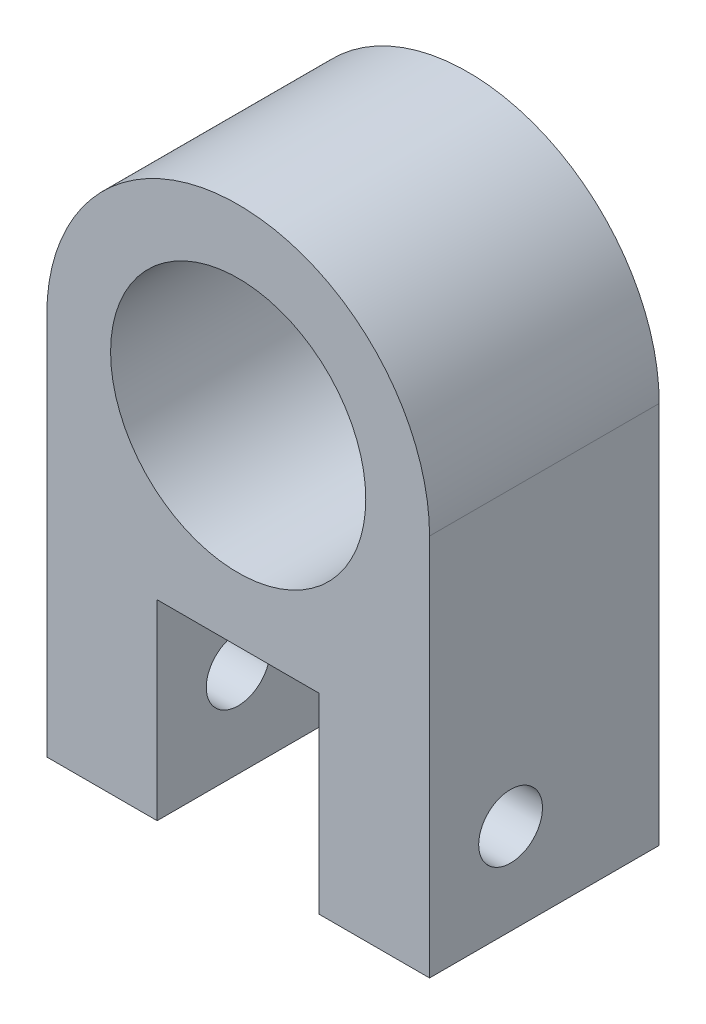
ISO-10303-21;
HEADER;
FILE_DESCRIPTION(('STEP AP214'),'2;1');
FILE_NAME('part.step','',(''),(''),'','','');
FILE_SCHEMA(('AUTOMOTIVE_DESIGN { 1 0 10303 214 1 1 1 1 }'));
ENDSEC;
DATA;
#1=APPLICATION_CONTEXT('core data for automotive mechanical design processes');
#2=APPLICATION_PROTOCOL_DEFINITION('international standard','automotive_design',2000,#1);
#3=PRODUCT_CONTEXT('',#1,'mechanical');
#4=PRODUCT('Part','Part','',(#3));
#5=PRODUCT_RELATED_PRODUCT_CATEGORY('part','',(#4));
#6=PRODUCT_DEFINITION_FORMATION('','',#4);
#7=PRODUCT_DEFINITION_CONTEXT('part definition',#1,'design');
#8=PRODUCT_DEFINITION('design','',#6,#7);
#9=PRODUCT_DEFINITION_SHAPE('','',#8);
#10=(LENGTH_UNIT() NAMED_UNIT(*) SI_UNIT(.MILLI.,.METRE.));
#11=(NAMED_UNIT(*) PLANE_ANGLE_UNIT() SI_UNIT($,.RADIAN.));
#12=(NAMED_UNIT(*) SI_UNIT($,.STERADIAN.) SOLID_ANGLE_UNIT());
#13=UNCERTAINTY_MEASURE_WITH_UNIT(LENGTH_MEASURE(1.E-05),#10,'distance_accuracy_value','');
#14=(GEOMETRIC_REPRESENTATION_CONTEXT(3) GLOBAL_UNCERTAINTY_ASSIGNED_CONTEXT((#13)) GLOBAL_UNIT_ASSIGNED_CONTEXT((#10,
#11,#12)) REPRESENTATION_CONTEXT('',''));
#15=CARTESIAN_POINT('',(0.,0.,0.));
#16=DIRECTION('',(0.,0.,1.));
#17=DIRECTION('',(1.,0.,0.));
#18=AXIS2_PLACEMENT_3D('',#15,#16,#17);
#19=CARTESIAN_POINT('',(15.,30.,18.));
#20=DIRECTION('',(0.,0.,-1.));
#21=DIRECTION('',(-1.,0.,0.));
#22=AXIS2_PLACEMENT_3D('',#19,#20,#21);
#23=PLANE('',#22);
#24=DIRECTION('',(-1.,0.,0.));
#25=VECTOR('',#24,1.);
#26=CARTESIAN_POINT('',(8.65,15.,18.));
#27=LINE('',#26,#25);
#28=CARTESIAN_POINT('',(21.35,15.,18.));
#29=VERTEX_POINT('',#28);
#30=CARTESIAN_POINT('',(8.65,15.,18.));
#31=VERTEX_POINT('',#30);
#32=EDGE_CURVE('E130',#29,#31,#27,.T.);
#33=ORIENTED_EDGE('',*,*,#32,.F.);
#34=DIRECTION('',(0.,1.,0.));
#35=VECTOR('',#34,1.);
#36=CARTESIAN_POINT('',(21.35,15.,18.));
#37=LINE('',#36,#35);
#38=CARTESIAN_POINT('',(21.35,0.,18.));
#39=VERTEX_POINT('',#38);
#40=EDGE_CURVE('E115',#39,#29,#37,.T.);
#41=ORIENTED_EDGE('',*,*,#40,.F.);
#42=DIRECTION('',(1.,0.,0.));
#43=VECTOR('',#42,1.);
#44=CARTESIAN_POINT('',(0.,0.,18.));
#45=LINE('',#44,#43);
#46=CARTESIAN_POINT('',(30.,0.,18.));
#47=VERTEX_POINT('',#46);
#48=EDGE_CURVE('E154',#39,#47,#45,.T.);
#49=ORIENTED_EDGE('',*,*,#48,.T.);
#50=DIRECTION('',(0.,1.,0.));
#51=VECTOR('',#50,1.);
#52=CARTESIAN_POINT('',(30.,0.,18.));
#53=LINE('',#52,#51);
#54=CARTESIAN_POINT('',(30.,30.,18.));
#55=VERTEX_POINT('',#54);
#56=EDGE_CURVE('E156',#47,#55,#53,.T.);
#57=ORIENTED_EDGE('',*,*,#56,.T.);
#58=CARTESIAN_POINT('',(15.,30.,18.));
#59=DIRECTION('',(0.,0.,1.));
#60=DIRECTION('',(-1.,0.,0.));
#61=AXIS2_PLACEMENT_3D('',#58,#59,#60);
#62=CIRCLE('',#61,15.);
#63=CARTESIAN_POINT('',(0.,30.,18.));
#64=VERTEX_POINT('',#63);
#65=EDGE_CURVE('E57',#55,#64,#62,.T.);
#66=ORIENTED_EDGE('',*,*,#65,.T.);
#67=DIRECTION('',(0.,-1.,0.));
#68=VECTOR('',#67,1.);
#69=CARTESIAN_POINT('',(0.,0.,18.));
#70=LINE('',#69,#68);
#71=CARTESIAN_POINT('',(0.,0.,18.));
#72=VERTEX_POINT('',#71);
#73=EDGE_CURVE('E152',#64,#72,#70,.T.);
#74=ORIENTED_EDGE('',*,*,#73,.T.);
#75=CARTESIAN_POINT('',(8.65,0.,18.));
#76=VERTEX_POINT('',#75);
#77=EDGE_CURVE('E85',#72,#76,#45,.T.);
#78=ORIENTED_EDGE('',*,*,#77,.T.);
#79=DIRECTION('',(0.,-1.,0.));
#80=VECTOR('',#79,1.);
#81=CARTESIAN_POINT('',(8.65,15.,18.));
#82=LINE('',#81,#80);
#83=EDGE_CURVE('E128',#31,#76,#82,.T.);
#84=ORIENTED_EDGE('',*,*,#83,.F.);
#85=EDGE_LOOP('',(#33,#41,#49,#57,#66,#74,#78,#84));
#86=FACE_BOUND('',#85,.T.);
#87=CARTESIAN_POINT('',(15.,30.,18.));
#88=DIRECTION('',(0.,0.,1.));
#89=DIRECTION('',(1.,0.,0.));
#90=AXIS2_PLACEMENT_3D('',#87,#88,#89);
#91=CIRCLE('',#90,10.);
#92=CARTESIAN_POINT('',(25.,30.,18.));
#93=VERTEX_POINT('',#92);
#94=EDGE_CURVE('E146',#93,#93,#91,.T.);
#95=ORIENTED_EDGE('',*,*,#94,.F.);
#96=EDGE_LOOP('',(#95));
#97=FACE_BOUND('',#96,.T.);
#98=ADVANCED_FACE('F32',(#86,#97),#23,.F.);
#99=CARTESIAN_POINT('',(15.,30.,0.));
#100=DIRECTION('',(0.,0.,-1.));
#101=DIRECTION('',(-1.,0.,0.));
#102=AXIS2_PLACEMENT_3D('',#99,#100,#101);
#103=PLANE('',#102);
#104=DIRECTION('',(0.,-1.,0.));
#105=VECTOR('',#104,1.);
#106=CARTESIAN_POINT('',(0.,0.,0.));
#107=LINE('',#106,#105);
#108=CARTESIAN_POINT('',(0.,30.,0.));
#109=VERTEX_POINT('',#108);
#110=CARTESIAN_POINT('',(0.,0.,0.));
#111=VERTEX_POINT('',#110);
#112=EDGE_CURVE('E149',#109,#111,#107,.T.);
#113=ORIENTED_EDGE('',*,*,#112,.F.);
#114=CARTESIAN_POINT('',(15.,30.,0.));
#115=DIRECTION('',(0.,0.,1.));
#116=DIRECTION('',(-1.,0.,0.));
#117=AXIS2_PLACEMENT_3D('',#114,#115,#116);
#118=CIRCLE('',#117,15.);
#119=CARTESIAN_POINT('',(30.,30.,0.));
#120=VERTEX_POINT('',#119);
#121=EDGE_CURVE('E78',#120,#109,#118,.T.);
#122=ORIENTED_EDGE('',*,*,#121,.F.);
#123=DIRECTION('',(0.,1.,0.));
#124=VECTOR('',#123,1.);
#125=CARTESIAN_POINT('',(30.,0.,0.));
#126=LINE('',#125,#124);
#127=CARTESIAN_POINT('',(30.,0.,0.));
#128=VERTEX_POINT('',#127);
#129=EDGE_CURVE('E164',#128,#120,#126,.T.);
#130=ORIENTED_EDGE('',*,*,#129,.F.);
#131=DIRECTION('',(1.,0.,0.));
#132=VECTOR('',#131,1.);
#133=CARTESIAN_POINT('',(0.,0.,0.));
#134=LINE('',#133,#132);
#135=EDGE_CURVE('E162',#111,#128,#134,.T.);
#136=ORIENTED_EDGE('',*,*,#135,.F.);
#137=EDGE_LOOP('',(#113,#122,#130,#136));
#138=FACE_BOUND('',#137,.T.);
#139=CARTESIAN_POINT('',(15.,30.,0.));
#140=DIRECTION('',(0.,0.,1.));
#141=DIRECTION('',(1.,0.,0.));
#142=AXIS2_PLACEMENT_3D('',#139,#140,#141);
#143=CIRCLE('',#142,10.);
#144=CARTESIAN_POINT('',(25.,30.,0.));
#145=VERTEX_POINT('',#144);
#146=EDGE_CURVE('E142',#145,#145,#143,.T.);
#147=ORIENTED_EDGE('',*,*,#146,.T.);
#148=EDGE_LOOP('',(#147));
#149=FACE_BOUND('',#148,.T.);
#150=ADVANCED_FACE('F180',(#138,#149),#103,.T.);
#151=CARTESIAN_POINT('',(0.,0.,18.));
#152=DIRECTION('',(1.,0.,0.));
#153=DIRECTION('',(0.,0.,-1.));
#154=AXIS2_PLACEMENT_3D('',#151,#152,#153);
#155=PLANE('',#154);
#156=CARTESIAN_POINT('',(0.,7.125,11.65));
#157=DIRECTION('',(-1.,0.,0.));
#158=DIRECTION('',(0.,0.,1.));
#159=AXIS2_PLACEMENT_3D('',#156,#157,#158);
#160=CIRCLE('',#159,2.5);
#161=CARTESIAN_POINT('',(0.,7.125,14.15));
#162=VERTEX_POINT('',#161);
#163=EDGE_CURVE('E233',#162,#162,#160,.T.);
#164=ORIENTED_EDGE('',*,*,#163,.F.);
#165=EDGE_LOOP('',(#164));
#166=FACE_BOUND('',#165,.T.);
#167=ORIENTED_EDGE('',*,*,#112,.T.);
#168=DIRECTION('',(0.,0.,-1.));
#169=VECTOR('',#168,1.);
#170=CARTESIAN_POINT('',(0.,0.,18.));
#171=LINE('',#170,#169);
#172=EDGE_CURVE('E11',#72,#111,#171,.T.);
#173=ORIENTED_EDGE('',*,*,#172,.F.);
#174=ORIENTED_EDGE('',*,*,#73,.F.);
#175=DIRECTION('',(0.,0.,-1.));
#176=VECTOR('',#175,1.);
#177=CARTESIAN_POINT('',(0.,30.,18.));
#178=LINE('',#177,#176);
#179=EDGE_CURVE('E159',#64,#109,#178,.T.);
#180=ORIENTED_EDGE('',*,*,#179,.T.);
#181=EDGE_LOOP('',(#167,#173,#174,#180));
#182=FACE_BOUND('',#181,.T.);
#183=ADVANCED_FACE('F34',(#166,#182),#155,.F.);
#184=CARTESIAN_POINT('',(0.,0.,18.));
#185=DIRECTION('',(0.,1.,0.));
#186=DIRECTION('',(0.,0.,1.));
#187=AXIS2_PLACEMENT_3D('',#184,#185,#186);
#188=PLANE('',#187);
#189=ORIENTED_EDGE('',*,*,#48,.F.);
#190=DIRECTION('',(0.,0.,1.));
#191=VECTOR('',#190,1.);
#192=CARTESIAN_POINT('',(21.35,0.,5.3));
#193=LINE('',#192,#191);
#194=CARTESIAN_POINT('',(21.35,0.,5.3));
#195=VERTEX_POINT('',#194);
#196=EDGE_CURVE('E140',#195,#39,#193,.T.);
#197=ORIENTED_EDGE('',*,*,#196,.F.);
#198=DIRECTION('',(1.,0.,0.));
#199=VECTOR('',#198,1.);
#200=CARTESIAN_POINT('',(8.65,0.,5.3));
#201=LINE('',#200,#199);
#202=CARTESIAN_POINT('',(8.65,0.,5.3));
#203=VERTEX_POINT('',#202);
#204=EDGE_CURVE('E120',#203,#195,#201,.T.);
#205=ORIENTED_EDGE('',*,*,#204,.F.);
#206=DIRECTION('',(0.,0.,1.));
#207=VECTOR('',#206,1.);
#208=CARTESIAN_POINT('',(8.65,0.,5.3));
#209=LINE('',#208,#207);
#210=EDGE_CURVE('E143',#203,#76,#209,.T.);
#211=ORIENTED_EDGE('',*,*,#210,.T.);
#212=ORIENTED_EDGE('',*,*,#77,.F.);
#213=ORIENTED_EDGE('',*,*,#172,.T.);
#214=ORIENTED_EDGE('',*,*,#135,.T.);
#215=DIRECTION('',(0.,0.,-1.));
#216=VECTOR('',#215,1.);
#217=CARTESIAN_POINT('',(30.,0.,18.));
#218=LINE('',#217,#216);
#219=EDGE_CURVE('E41',#47,#128,#218,.T.);
#220=ORIENTED_EDGE('',*,*,#219,.F.);
#221=EDGE_LOOP('',(#189,#197,#205,#211,#212,#213,#214,#220));
#222=FACE_BOUND('',#221,.T.);
#223=ADVANCED_FACE('F195',(#222),#188,.F.);
#224=CARTESIAN_POINT('',(30.,0.,18.));
#225=DIRECTION('',(-1.,0.,0.));
#226=DIRECTION('',(0.,0.,1.));
#227=AXIS2_PLACEMENT_3D('',#224,#225,#226);
#228=PLANE('',#227);
#229=CARTESIAN_POINT('',(30.,7.125,11.65));
#230=DIRECTION('',(-1.,0.,0.));
#231=DIRECTION('',(0.,0.,1.));
#232=AXIS2_PLACEMENT_3D('',#229,#230,#231);
#233=CIRCLE('',#232,2.5);
#234=CARTESIAN_POINT('',(30.,7.125,14.15));
#235=VERTEX_POINT('',#234);
#236=EDGE_CURVE('E228',#235,#235,#233,.T.);
#237=ORIENTED_EDGE('',*,*,#236,.T.);
#238=EDGE_LOOP('',(#237));
#239=FACE_BOUND('',#238,.T.);
#240=ORIENTED_EDGE('',*,*,#129,.T.);
#241=DIRECTION('',(0.,0.,-1.));
#242=VECTOR('',#241,1.);
#243=CARTESIAN_POINT('',(30.,30.,18.));
#244=LINE('',#243,#242);
#245=EDGE_CURVE('E168',#55,#120,#244,.T.);
#246=ORIENTED_EDGE('',*,*,#245,.F.);
#247=ORIENTED_EDGE('',*,*,#56,.F.);
#248=ORIENTED_EDGE('',*,*,#219,.T.);
#249=EDGE_LOOP('',(#240,#246,#247,#248));
#250=FACE_BOUND('',#249,.T.);
#251=ADVANCED_FACE('F175',(#239,#250),#228,.F.);
#252=CARTESIAN_POINT('',(15.,30.,18.));
#253=DIRECTION('',(0.,0.,-1.));
#254=DIRECTION('',(-1.,0.,0.));
#255=AXIS2_PLACEMENT_3D('',#252,#253,#254);
#256=CYLINDRICAL_SURFACE('',#255,15.);
#257=ORIENTED_EDGE('',*,*,#121,.T.);
#258=ORIENTED_EDGE('',*,*,#179,.F.);
#259=ORIENTED_EDGE('',*,*,#65,.F.);
#260=ORIENTED_EDGE('',*,*,#245,.T.);
#261=EDGE_LOOP('',(#257,#258,#259,#260));
#262=FACE_BOUND('',#261,.T.);
#263=ADVANCED_FACE('F185',(#262),#256,.T.);
#264=CARTESIAN_POINT('',(15.,30.,18.));
#265=DIRECTION('',(0.,0.,-1.));
#266=DIRECTION('',(-1.,0.,0.));
#267=AXIS2_PLACEMENT_3D('',#264,#265,#266);
#268=CYLINDRICAL_SURFACE('',#267,10.);
#269=ORIENTED_EDGE('',*,*,#94,.T.);
#270=EDGE_LOOP('',(#269));
#271=FACE_BOUND('',#270,.T.);
#272=ORIENTED_EDGE('',*,*,#146,.F.);
#273=EDGE_LOOP('',(#272));
#274=FACE_BOUND('',#273,.T.);
#275=ADVANCED_FACE('F187',(#271,#274),#268,.F.);
#276=CARTESIAN_POINT('',(21.35,15.,5.3));
#277=DIRECTION('',(1.,0.,0.));
#278=DIRECTION('',(0.,1.,0.));
#279=AXIS2_PLACEMENT_3D('',#276,#277,#278);
#280=PLANE('',#279);
#281=CARTESIAN_POINT('',(21.35,7.125,11.65));
#282=DIRECTION('',(1.,0.,0.));
#283=DIRECTION('',(0.,1.,0.));
#284=AXIS2_PLACEMENT_3D('',#281,#282,#283);
#285=CIRCLE('',#284,2.5);
#286=CARTESIAN_POINT('',(21.35,9.625,11.65));
#287=VERTEX_POINT('',#286);
#288=EDGE_CURVE('E133',#287,#287,#285,.T.);
#289=ORIENTED_EDGE('',*,*,#288,.T.);
#290=EDGE_LOOP('',(#289));
#291=FACE_BOUND('',#290,.T.);
#292=ORIENTED_EDGE('',*,*,#40,.T.);
#293=DIRECTION('',(0.,0.,1.));
#294=VECTOR('',#293,1.);
#295=CARTESIAN_POINT('',(21.35,15.,5.3));
#296=LINE('',#295,#294);
#297=CARTESIAN_POINT('',(21.35,15.,5.3));
#298=VERTEX_POINT('',#297);
#299=EDGE_CURVE('E109',#298,#29,#296,.T.);
#300=ORIENTED_EDGE('',*,*,#299,.F.);
#301=DIRECTION('',(0.,1.,0.));
#302=VECTOR('',#301,1.);
#303=CARTESIAN_POINT('',(21.35,15.,5.3));
#304=LINE('',#303,#302);
#305=EDGE_CURVE('E113',#195,#298,#304,.T.);
#306=ORIENTED_EDGE('',*,*,#305,.F.);
#307=ORIENTED_EDGE('',*,*,#196,.T.);
#308=EDGE_LOOP('',(#292,#300,#306,#307));
#309=FACE_BOUND('',#308,.T.);
#310=ADVANCED_FACE('F111',(#291,#309),#280,.F.);
#311=CARTESIAN_POINT('',(8.65,15.,5.3));
#312=DIRECTION('',(-1.,0.,0.));
#313=DIRECTION('',(0.,-1.,0.));
#314=AXIS2_PLACEMENT_3D('',#311,#312,#313);
#315=PLANE('',#314);
#316=CARTESIAN_POINT('',(8.65,7.125,11.65));
#317=DIRECTION('',(-1.,0.,0.));
#318=DIRECTION('',(0.,-1.,0.));
#319=AXIS2_PLACEMENT_3D('',#316,#317,#318);
#320=CIRCLE('',#319,2.5);
#321=CARTESIAN_POINT('',(8.65,4.625,11.65));
#322=VERTEX_POINT('',#321);
#323=EDGE_CURVE('E36',#322,#322,#320,.T.);
#324=ORIENTED_EDGE('',*,*,#323,.T.);
#325=EDGE_LOOP('',(#324));
#326=FACE_BOUND('',#325,.T.);
#327=ORIENTED_EDGE('',*,*,#83,.T.);
#328=ORIENTED_EDGE('',*,*,#210,.F.);
#329=DIRECTION('',(0.,-1.,0.));
#330=VECTOR('',#329,1.);
#331=CARTESIAN_POINT('',(8.65,15.,5.3));
#332=LINE('',#331,#330);
#333=CARTESIAN_POINT('',(8.65,15.,5.3));
#334=VERTEX_POINT('',#333);
#335=EDGE_CURVE('E48',#334,#203,#332,.T.);
#336=ORIENTED_EDGE('',*,*,#335,.F.);
#337=DIRECTION('',(0.,0.,1.));
#338=VECTOR('',#337,1.);
#339=CARTESIAN_POINT('',(8.65,15.,5.3));
#340=LINE('',#339,#338);
#341=EDGE_CURVE('E119',#334,#31,#340,.T.);
#342=ORIENTED_EDGE('',*,*,#341,.T.);
#343=EDGE_LOOP('',(#327,#328,#336,#342));
#344=FACE_BOUND('',#343,.T.);
#345=ADVANCED_FACE('F208',(#326,#344),#315,.F.);
#346=CARTESIAN_POINT('',(8.65,15.,5.3));
#347=DIRECTION('',(0.,1.,0.));
#348=DIRECTION('',(0.,0.,1.));
#349=AXIS2_PLACEMENT_3D('',#346,#347,#348);
#350=PLANE('',#349);
#351=ORIENTED_EDGE('',*,*,#32,.T.);
#352=ORIENTED_EDGE('',*,*,#341,.F.);
#353=DIRECTION('',(-1.,0.,0.));
#354=VECTOR('',#353,1.);
#355=CARTESIAN_POINT('',(8.65,15.,5.3));
#356=LINE('',#355,#354);
#357=EDGE_CURVE('E122',#298,#334,#356,.T.);
#358=ORIENTED_EDGE('',*,*,#357,.F.);
#359=ORIENTED_EDGE('',*,*,#299,.T.);
#360=EDGE_LOOP('',(#351,#352,#358,#359));
#361=FACE_BOUND('',#360,.T.);
#362=ADVANCED_FACE('F123',(#361),#350,.F.);
#363=CARTESIAN_POINT('',(0.,0.,5.3));
#364=DIRECTION('',(0.,0.,1.));
#365=DIRECTION('',(1.,0.,0.));
#366=AXIS2_PLACEMENT_3D('',#363,#364,#365);
#367=PLANE('',#366);
#368=ORIENTED_EDGE('',*,*,#305,.T.);
#369=ORIENTED_EDGE('',*,*,#357,.T.);
#370=ORIENTED_EDGE('',*,*,#335,.T.);
#371=ORIENTED_EDGE('',*,*,#204,.T.);
#372=EDGE_LOOP('',(#368,#369,#370,#371));
#373=FACE_BOUND('',#372,.T.);
#374=ADVANCED_FACE('F125',(#373),#367,.T.);
#375=CARTESIAN_POINT('',(30.,7.125,11.65));
#376=DIRECTION('',(-1.,0.,0.));
#377=DIRECTION('',(0.,0.,1.));
#378=AXIS2_PLACEMENT_3D('',#375,#376,#377);
#379=CYLINDRICAL_SURFACE('',#378,2.5);
#380=ORIENTED_EDGE('',*,*,#163,.T.);
#381=EDGE_LOOP('',(#380));
#382=FACE_BOUND('',#381,.T.);
#383=ORIENTED_EDGE('',*,*,#323,.F.);
#384=EDGE_LOOP('',(#383));
#385=FACE_BOUND('',#384,.T.);
#386=ADVANCED_FACE('F217',(#382,#385),#379,.F.);
#387=ORIENTED_EDGE('',*,*,#236,.F.);
#388=EDGE_LOOP('',(#387));
#389=FACE_BOUND('',#388,.T.);
#390=ORIENTED_EDGE('',*,*,#288,.F.);
#391=EDGE_LOOP('',(#390));
#392=FACE_BOUND('',#391,.T.);
#393=ADVANCED_FACE('F218',(#389,#392),#379,.F.);
#394=CLOSED_SHELL('',(#98,#150,#183,#223,#251,#263,#275,#310,#345,#362,#374,#386,#393));
#395=MANIFOLD_SOLID_BREP('B2',#394);
#396=ADVANCED_BREP_SHAPE_REPRESENTATION('',(#18,#395),#14);
#397=SHAPE_DEFINITION_REPRESENTATION(#9,#396);
ENDSEC;
END-ISO-10303-21;
